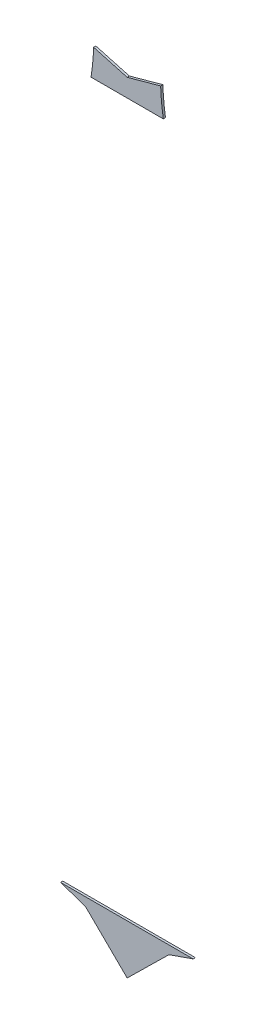
ISO-10303-21;
HEADER;
FILE_DESCRIPTION(('STEP AP214'),'2;1');
FILE_NAME('part.step','',(''),(''),'','','');
FILE_SCHEMA(('AUTOMOTIVE_DESIGN { 1 0 10303 214 1 1 1 1 }'));
ENDSEC;
DATA;
#1=APPLICATION_CONTEXT('core data for automotive mechanical design processes');
#2=APPLICATION_PROTOCOL_DEFINITION('international standard','automotive_design',2000,#1);
#3=PRODUCT_CONTEXT('',#1,'mechanical');
#4=PRODUCT('Part','Part','',(#3));
#5=PRODUCT_RELATED_PRODUCT_CATEGORY('part','',(#4));
#6=PRODUCT_DEFINITION_FORMATION('','',#4);
#7=PRODUCT_DEFINITION_CONTEXT('part definition',#1,'design');
#8=PRODUCT_DEFINITION('design','',#6,#7);
#9=PRODUCT_DEFINITION_SHAPE('','',#8);
#10=(LENGTH_UNIT() NAMED_UNIT(*) SI_UNIT(.MILLI.,.METRE.));
#11=(NAMED_UNIT(*) PLANE_ANGLE_UNIT() SI_UNIT($,.RADIAN.));
#12=(NAMED_UNIT(*) SI_UNIT($,.STERADIAN.) SOLID_ANGLE_UNIT());
#13=UNCERTAINTY_MEASURE_WITH_UNIT(LENGTH_MEASURE(1.E-05),#10,'distance_accuracy_value','');
#14=(GEOMETRIC_REPRESENTATION_CONTEXT(3) GLOBAL_UNCERTAINTY_ASSIGNED_CONTEXT((#13)) GLOBAL_UNIT_ASSIGNED_CONTEXT((#10,
#11,#12)) REPRESENTATION_CONTEXT('',''));
#15=CARTESIAN_POINT('',(0.,0.,0.));
#16=DIRECTION('',(0.,0.,1.));
#17=DIRECTION('',(1.,0.,0.));
#18=AXIS2_PLACEMENT_3D('',#15,#16,#17);
#19=CARTESIAN_POINT('',(39.2658083058148,-0.911572928917991,0.1));
#20=DIRECTION('',(-0.329181682712164,0.944266604178496,0.));
#21=DIRECTION('',(-0.944266604178496,-0.329181682712164,0.));
#22=AXIS2_PLACEMENT_3D('',#19,#20,#21);
#23=PLANE('',#22);
#24=DIRECTION('',(0.944266604178496,0.329181682712164,0.));
#25=VECTOR('',#24,1.);
#26=CARTESIAN_POINT('',(39.2658083058148,-0.911572928917991,0.));
#27=LINE('',#26,#25);
#28=CARTESIAN_POINT('',(38.1773001093702,-1.29103881086915,0.));
#29=VERTEX_POINT('',#28);
#30=CARTESIAN_POINT('',(39.2658083058148,-0.911572928917991,0.));
#31=VERTEX_POINT('',#30);
#32=EDGE_CURVE('E117',#29,#31,#27,.T.);
#33=ORIENTED_EDGE('',*,*,#32,.T.);
#34=DIRECTION('',(0.,0.,-1.));
#35=VECTOR('',#34,1.);
#36=CARTESIAN_POINT('',(39.2658083058148,-0.911572928917991,0.1));
#37=LINE('',#36,#35);
#38=CARTESIAN_POINT('',(39.2658083058148,-0.911572928917991,0.1));
#39=VERTEX_POINT('',#38);
#40=EDGE_CURVE('E12',#39,#31,#37,.T.);
#41=ORIENTED_EDGE('',*,*,#40,.F.);
#42=DIRECTION('',(0.944266604178496,0.329181682712164,0.));
#43=VECTOR('',#42,1.);
#44=CARTESIAN_POINT('',(39.2658083058148,-0.911572928917991,0.1));
#45=LINE('',#44,#43);
#46=CARTESIAN_POINT('',(38.1773001093702,-1.29103881086915,0.1));
#47=VERTEX_POINT('',#46);
#48=EDGE_CURVE('E125',#47,#39,#45,.T.);
#49=ORIENTED_EDGE('',*,*,#48,.F.);
#50=DIRECTION('',(0.,0.,-1.));
#51=VECTOR('',#50,1.);
#52=CARTESIAN_POINT('',(38.1773001093702,-1.29103881086915,0.1));
#53=LINE('',#52,#51);
#54=EDGE_CURVE('E113',#47,#29,#53,.T.);
#55=ORIENTED_EDGE('',*,*,#54,.T.);
#56=EDGE_LOOP('',(#33,#41,#49,#55));
#57=FACE_BOUND('',#56,.T.);
#58=ADVANCED_FACE('F43',(#57),#23,.F.);
#59=CARTESIAN_POINT('',(39.2658083058148,-0.911572928917991,0.1));
#60=DIRECTION('',(0.,-1.,0.));
#61=DIRECTION('',(0.,0.,-1.));
#62=AXIS2_PLACEMENT_3D('',#59,#60,#61);
#63=PLANE('',#62);
#64=DIRECTION('',(-1.,0.,0.));
#65=VECTOR('',#64,1.);
#66=CARTESIAN_POINT('',(39.2658083058148,-0.911572928917991,0.));
#67=LINE('',#66,#65);
#68=CARTESIAN_POINT('',(33.3110708178229,-0.911572928917991,0.));
#69=VERTEX_POINT('',#68);
#70=EDGE_CURVE('E120',#31,#69,#67,.T.);
#71=ORIENTED_EDGE('',*,*,#70,.T.);
#72=DIRECTION('',(0.,0.,-1.));
#73=VECTOR('',#72,1.);
#74=CARTESIAN_POINT('',(33.3110708178229,-0.911572928917991,0.1));
#75=LINE('',#74,#73);
#76=CARTESIAN_POINT('',(33.3110708178229,-0.911572928917991,0.1));
#77=VERTEX_POINT('',#76);
#78=EDGE_CURVE('E51',#77,#69,#75,.T.);
#79=ORIENTED_EDGE('',*,*,#78,.F.);
#80=DIRECTION('',(-1.,0.,0.));
#81=VECTOR('',#80,1.);
#82=CARTESIAN_POINT('',(39.2658083058148,-0.911572928917991,0.1));
#83=LINE('',#82,#81);
#84=EDGE_CURVE('E93',#39,#77,#83,.T.);
#85=ORIENTED_EDGE('',*,*,#84,.F.);
#86=ORIENTED_EDGE('',*,*,#40,.T.);
#87=EDGE_LOOP('',(#71,#79,#85,#86));
#88=FACE_BOUND('',#87,.T.);
#89=ADVANCED_FACE('F144',(#88),#63,.F.);
#90=CARTESIAN_POINT('',(34.4264076718275,-1.29121695948299,0.1));
#91=DIRECTION('',(0.322229485113042,0.946661586272404,0.));
#92=DIRECTION('',(-0.946661586272404,0.322229485113042,0.));
#93=AXIS2_PLACEMENT_3D('',#90,#91,#92);
#94=PLANE('',#93);
#95=DIRECTION('',(0.946661586272404,-0.322229485113042,0.));
#96=VECTOR('',#95,1.);
#97=CARTESIAN_POINT('',(34.4264076718275,-1.29121695948299,0.));
#98=LINE('',#97,#96);
#99=CARTESIAN_POINT('',(34.4264076718275,-1.29121695948299,0.));
#100=VERTEX_POINT('',#99);
#101=EDGE_CURVE('E108',#69,#100,#98,.T.);
#102=ORIENTED_EDGE('',*,*,#101,.T.);
#103=DIRECTION('',(0.,0.,-1.));
#104=VECTOR('',#103,1.);
#105=CARTESIAN_POINT('',(34.4264076718275,-1.29121695948299,0.1));
#106=LINE('',#105,#104);
#107=CARTESIAN_POINT('',(34.4264076718275,-1.29121695948299,0.1));
#108=VERTEX_POINT('',#107);
#109=EDGE_CURVE('E105',#108,#100,#106,.T.);
#110=ORIENTED_EDGE('',*,*,#109,.F.);
#111=DIRECTION('',(0.946661586272404,-0.322229485113042,0.));
#112=VECTOR('',#111,1.);
#113=CARTESIAN_POINT('',(34.4264076718275,-1.29121695948299,0.1));
#114=LINE('',#113,#112);
#115=EDGE_CURVE('E97',#77,#108,#114,.T.);
#116=ORIENTED_EDGE('',*,*,#115,.F.);
#117=ORIENTED_EDGE('',*,*,#78,.T.);
#118=EDGE_LOOP('',(#102,#110,#116,#117));
#119=FACE_BOUND('',#118,.T.);
#120=ADVANCED_FACE('F106',(#119),#94,.F.);
#121=CARTESIAN_POINT('',(36.301941466188,-3.1350188240396,0.1));
#122=DIRECTION('',(0.701048506646403,0.713113589359261,0.));
#123=DIRECTION('',(-0.71311358935926,0.701048506646403,0.));
#124=AXIS2_PLACEMENT_3D('',#121,#122,#123);
#125=PLANE('',#124);
#126=DIRECTION('',(0.713113589359261,-0.701048506646403,0.));
#127=VECTOR('',#126,1.);
#128=CARTESIAN_POINT('',(36.301941466188,-3.1350188240396,0.));
#129=LINE('',#128,#127);
#130=CARTESIAN_POINT('',(36.301941466188,-3.1350188240396,0.));
#131=VERTEX_POINT('',#130);
#132=EDGE_CURVE('E79',#100,#131,#129,.T.);
#133=ORIENTED_EDGE('',*,*,#132,.T.);
#134=DIRECTION('',(0.,0.,-1.));
#135=VECTOR('',#134,1.);
#136=CARTESIAN_POINT('',(36.301941466188,-3.1350188240396,0.1));
#137=LINE('',#136,#135);
#138=CARTESIAN_POINT('',(36.301941466188,-3.1350188240396,0.1));
#139=VERTEX_POINT('',#138);
#140=EDGE_CURVE('E109',#139,#131,#137,.T.);
#141=ORIENTED_EDGE('',*,*,#140,.F.);
#142=DIRECTION('',(0.713113589359261,-0.701048506646403,0.));
#143=VECTOR('',#142,1.);
#144=CARTESIAN_POINT('',(36.301941466188,-3.1350188240396,0.1));
#145=LINE('',#144,#143);
#146=EDGE_CURVE('E101',#108,#139,#145,.T.);
#147=ORIENTED_EDGE('',*,*,#146,.F.);
#148=ORIENTED_EDGE('',*,*,#109,.T.);
#149=EDGE_LOOP('',(#133,#141,#147,#148));
#150=FACE_BOUND('',#149,.T.);
#151=ADVANCED_FACE('F111',(#150),#125,.F.);
#152=CARTESIAN_POINT('',(38.1773001093702,-1.29103881086915,0.1));
#153=DIRECTION('',(-0.70111624213474,0.713046993552922,0.));
#154=DIRECTION('',(-0.713046993552922,-0.70111624213474,0.));
#155=AXIS2_PLACEMENT_3D('',#152,#153,#154);
#156=PLANE('',#155);
#157=DIRECTION('',(0.713046993552922,0.70111624213474,0.));
#158=VECTOR('',#157,1.);
#159=CARTESIAN_POINT('',(38.1773001093702,-1.29103881086915,0.));
#160=LINE('',#159,#158);
#161=EDGE_CURVE('E85',#131,#29,#160,.T.);
#162=ORIENTED_EDGE('',*,*,#161,.T.);
#163=ORIENTED_EDGE('',*,*,#54,.F.);
#164=DIRECTION('',(0.713046993552922,0.70111624213474,0.));
#165=VECTOR('',#164,1.);
#166=CARTESIAN_POINT('',(38.1773001093702,-1.29103881086915,0.1));
#167=LINE('',#166,#165);
#168=EDGE_CURVE('E59',#139,#47,#167,.T.);
#169=ORIENTED_EDGE('',*,*,#168,.F.);
#170=ORIENTED_EDGE('',*,*,#140,.T.);
#171=EDGE_LOOP('',(#162,#163,#169,#170));
#172=FACE_BOUND('',#171,.T.);
#173=ADVANCED_FACE('F133',(#172),#156,.F.);
#174=CARTESIAN_POINT('',(0.,0.,0.1));
#175=DIRECTION('',(0.,0.,-1.));
#176=DIRECTION('',(-1.,0.,0.));
#177=AXIS2_PLACEMENT_3D('',#174,#175,#176);
#178=PLANE('',#177);
#179=ORIENTED_EDGE('',*,*,#48,.T.);
#180=ORIENTED_EDGE('',*,*,#84,.T.);
#181=ORIENTED_EDGE('',*,*,#115,.T.);
#182=ORIENTED_EDGE('',*,*,#146,.T.);
#183=ORIENTED_EDGE('',*,*,#168,.T.);
#184=EDGE_LOOP('',(#179,#180,#181,#182,#183));
#185=FACE_BOUND('',#184,.T.);
#186=ADVANCED_FACE('F99',(#185),#178,.F.);
#187=CARTESIAN_POINT('',(0.,0.,0.));
#188=DIRECTION('',(0.,0.,-1.));
#189=DIRECTION('',(-1.,0.,0.));
#190=AXIS2_PLACEMENT_3D('',#187,#188,#189);
#191=PLANE('',#190);
#192=ORIENTED_EDGE('',*,*,#32,.F.);
#193=ORIENTED_EDGE('',*,*,#161,.F.);
#194=ORIENTED_EDGE('',*,*,#132,.F.);
#195=ORIENTED_EDGE('',*,*,#101,.F.);
#196=ORIENTED_EDGE('',*,*,#70,.F.);
#197=EDGE_LOOP('',(#192,#193,#194,#195,#196));
#198=FACE_BOUND('',#197,.T.);
#199=ADVANCED_FACE('F129',(#198),#191,.T.);
#200=CLOSED_SHELL('',(#58,#89,#120,#151,#173,#186,#199));
#201=MANIFOLD_SOLID_BREP('B2',#200);
#202=CARTESIAN_POINT('',(24.7934683392651,32.6659006487027,0.1));
#203=DIRECTION('',(0.,0.,-1.));
#204=DIRECTION('',(-1.,0.,0.));
#205=AXIS2_PLACEMENT_3D('',#202,#203,#204);
#206=CYLINDRICAL_SURFACE('',#205,10.0094980833378);
#207=CARTESIAN_POINT('',(24.7934683392651,32.6659006487027,0.));
#208=DIRECTION('',(0.,0.,-1.));
#209=DIRECTION('',(1.,0.,0.));
#210=AXIS2_PLACEMENT_3D('',#207,#208,#209);
#211=CIRCLE('',#210,10.0094980833378);
#212=CARTESIAN_POINT('',(34.7966395943562,32.3100682138936,0.));
#213=VERTEX_POINT('',#212);
#214=CARTESIAN_POINT('',(34.6778817761996,31.088427071082,0.));
#215=VERTEX_POINT('',#214);
#216=EDGE_CURVE('E267',#213,#215,#211,.T.);
#217=ORIENTED_EDGE('',*,*,#216,.T.);
#218=DIRECTION('',(0.,0.,-1.));
#219=VECTOR('',#218,1.);
#220=CARTESIAN_POINT('',(34.6778817761996,31.088427071082,0.1));
#221=LINE('',#220,#219);
#222=CARTESIAN_POINT('',(34.6778817761996,31.088427071082,0.1));
#223=VERTEX_POINT('',#222);
#224=EDGE_CURVE('E41',#223,#215,#221,.T.);
#225=ORIENTED_EDGE('',*,*,#224,.F.);
#226=CARTESIAN_POINT('',(24.7934683392651,32.6659006487027,0.1));
#227=DIRECTION('',(0.,0.,-1.));
#228=DIRECTION('',(1.,0.,0.));
#229=AXIS2_PLACEMENT_3D('',#226,#227,#228);
#230=CIRCLE('',#229,10.0094980833378);
#231=CARTESIAN_POINT('',(34.7966395943562,32.3100682138936,0.1));
#232=VERTEX_POINT('',#231);
#233=EDGE_CURVE('E275',#232,#223,#230,.T.);
#234=ORIENTED_EDGE('',*,*,#233,.F.);
#235=DIRECTION('',(0.,0.,-1.));
#236=VECTOR('',#235,1.);
#237=CARTESIAN_POINT('',(34.7966395943562,32.3100682138936,0.1));
#238=LINE('',#237,#236);
#239=EDGE_CURVE('E263',#232,#213,#238,.T.);
#240=ORIENTED_EDGE('',*,*,#239,.T.);
#241=EDGE_LOOP('',(#217,#225,#234,#240));
#242=FACE_BOUND('',#241,.T.);
#243=ADVANCED_FACE('F193',(#242),#206,.F.);
#244=CARTESIAN_POINT('',(34.6778817761996,31.088427071082,0.1));
#245=DIRECTION('',(0.,1.,0.));
#246=DIRECTION('',(0.,0.,1.));
#247=AXIS2_PLACEMENT_3D('',#244,#245,#246);
#248=PLANE('',#247);
#249=DIRECTION('',(1.,0.,0.));
#250=VECTOR('',#249,1.);
#251=CARTESIAN_POINT('',(34.6778817761996,31.088427071082,0.));
#252=LINE('',#251,#250);
#253=CARTESIAN_POINT('',(37.9227748759127,31.088427071082,0.));
#254=VERTEX_POINT('',#253);
#255=EDGE_CURVE('E270',#215,#254,#252,.T.);
#256=ORIENTED_EDGE('',*,*,#255,.T.);
#257=DIRECTION('',(0.,0.,-1.));
#258=VECTOR('',#257,1.);
#259=CARTESIAN_POINT('',(37.9227748759127,31.088427071082,0.1));
#260=LINE('',#259,#258);
#261=CARTESIAN_POINT('',(37.9227748759127,31.088427071082,0.1));
#262=VERTEX_POINT('',#261);
#263=EDGE_CURVE('E201',#262,#254,#260,.T.);
#264=ORIENTED_EDGE('',*,*,#263,.F.);
#265=DIRECTION('',(1.,0.,0.));
#266=VECTOR('',#265,1.);
#267=CARTESIAN_POINT('',(34.6778817761996,31.088427071082,0.1));
#268=LINE('',#267,#266);
#269=EDGE_CURVE('E243',#223,#262,#268,.T.);
#270=ORIENTED_EDGE('',*,*,#269,.F.);
#271=ORIENTED_EDGE('',*,*,#224,.T.);
#272=EDGE_LOOP('',(#256,#264,#270,#271));
#273=FACE_BOUND('',#272,.T.);
#274=ADVANCED_FACE('F294',(#273),#248,.F.);
#275=CARTESIAN_POINT('',(47.8070138122859,32.666993676907,0.1));
#276=DIRECTION('',(0.,0.,-1.));
#277=DIRECTION('',(-1.,0.,0.));
#278=AXIS2_PLACEMENT_3D('',#275,#276,#277);
#279=CYLINDRICAL_SURFACE('',#278,10.0094980833378);
#280=CARTESIAN_POINT('',(47.8070138122859,32.666993676907,0.));
#281=DIRECTION('',(0.,0.,-1.));
#282=DIRECTION('',(1.,0.,0.));
#283=AXIS2_PLACEMENT_3D('',#280,#281,#282);
#284=CIRCLE('',#283,10.0094980833378);
#285=CARTESIAN_POINT('',(37.8038764028433,32.3102110425878,0.));
#286=VERTEX_POINT('',#285);
#287=EDGE_CURVE('E258',#254,#286,#284,.T.);
#288=ORIENTED_EDGE('',*,*,#287,.T.);
#289=DIRECTION('',(0.,0.,-1.));
#290=VECTOR('',#289,1.);
#291=CARTESIAN_POINT('',(37.8038764028433,32.3102110425878,0.1));
#292=LINE('',#291,#290);
#293=CARTESIAN_POINT('',(37.8038764028433,32.3102110425878,0.1));
#294=VERTEX_POINT('',#293);
#295=EDGE_CURVE('E255',#294,#286,#292,.T.);
#296=ORIENTED_EDGE('',*,*,#295,.F.);
#297=CARTESIAN_POINT('',(47.8070138122859,32.666993676907,0.1));
#298=DIRECTION('',(0.,0.,-1.));
#299=DIRECTION('',(1.,0.,0.));
#300=AXIS2_PLACEMENT_3D('',#297,#298,#299);
#301=CIRCLE('',#300,10.0094980833378);
#302=EDGE_CURVE('E247',#262,#294,#301,.T.);
#303=ORIENTED_EDGE('',*,*,#302,.F.);
#304=ORIENTED_EDGE('',*,*,#263,.T.);
#305=EDGE_LOOP('',(#288,#296,#303,#304));
#306=FACE_BOUND('',#305,.T.);
#307=ADVANCED_FACE('F256',(#306),#279,.F.);
#308=CARTESIAN_POINT('',(37.8038764028433,32.3102110425878,0.1));
#309=DIRECTION('',(0.26622205881868,-0.963911725936739,0.));
#310=DIRECTION('',(0.963911725936739,0.26622205881868,0.));
#311=AXIS2_PLACEMENT_3D('',#308,#309,#310);
#312=PLANE('',#311);
#313=DIRECTION('',(-0.963911725936739,-0.26622205881868,0.));
#314=VECTOR('',#313,1.);
#315=CARTESIAN_POINT('',(37.8038764028433,32.3102110425878,0.));
#316=LINE('',#315,#314);
#317=CARTESIAN_POINT('',(36.3017769907158,31.8953473291515,0.));
#318=VERTEX_POINT('',#317);
#319=EDGE_CURVE('E229',#286,#318,#316,.T.);
#320=ORIENTED_EDGE('',*,*,#319,.T.);
#321=DIRECTION('',(0.,0.,-1.));
#322=VECTOR('',#321,1.);
#323=CARTESIAN_POINT('',(36.3017769907158,31.8953473291515,0.1));
#324=LINE('',#323,#322);
#325=CARTESIAN_POINT('',(36.3017769907158,31.8953473291515,0.1));
#326=VERTEX_POINT('',#325);
#327=EDGE_CURVE('E259',#326,#318,#324,.T.);
#328=ORIENTED_EDGE('',*,*,#327,.F.);
#329=DIRECTION('',(-0.963911725936739,-0.26622205881868,0.));
#330=VECTOR('',#329,1.);
#331=CARTESIAN_POINT('',(37.8038764028433,32.3102110425878,0.1));
#332=LINE('',#331,#330);
#333=EDGE_CURVE('E251',#294,#326,#332,.T.);
#334=ORIENTED_EDGE('',*,*,#333,.F.);
#335=ORIENTED_EDGE('',*,*,#295,.T.);
#336=EDGE_LOOP('',(#320,#328,#334,#335));
#337=FACE_BOUND('',#336,.T.);
#338=ADVANCED_FACE('F261',(#337),#312,.F.);
#339=CARTESIAN_POINT('',(34.7966395943562,32.3100682138936,0.1));
#340=DIRECTION('',(-0.265637664121525,-0.964072938838167,0.));
#341=DIRECTION('',(0.964072938838167,-0.265637664121525,0.));
#342=AXIS2_PLACEMENT_3D('',#339,#340,#341);
#343=PLANE('',#342);
#344=DIRECTION('',(-0.964072938838167,0.265637664121525,0.));
#345=VECTOR('',#344,1.);
#346=CARTESIAN_POINT('',(34.7966395943562,32.3100682138936,0.));
#347=LINE('',#346,#345);
#348=EDGE_CURVE('E235',#318,#213,#347,.T.);
#349=ORIENTED_EDGE('',*,*,#348,.T.);
#350=ORIENTED_EDGE('',*,*,#239,.F.);
#351=DIRECTION('',(-0.964072938838167,0.265637664121525,0.));
#352=VECTOR('',#351,1.);
#353=CARTESIAN_POINT('',(34.7966395943562,32.3100682138936,0.1));
#354=LINE('',#353,#352);
#355=EDGE_CURVE('E209',#326,#232,#354,.T.);
#356=ORIENTED_EDGE('',*,*,#355,.F.);
#357=ORIENTED_EDGE('',*,*,#327,.T.);
#358=EDGE_LOOP('',(#349,#350,#356,#357));
#359=FACE_BOUND('',#358,.T.);
#360=ADVANCED_FACE('F283',(#359),#343,.F.);
#361=CARTESIAN_POINT('',(24.7934683392651,32.6659006487027,0.1));
#362=DIRECTION('',(0.,0.,1.));
#363=DIRECTION('',(1.,0.,0.));
#364=AXIS2_PLACEMENT_3D('',#361,#362,#363);
#365=PLANE('',#364);
#366=ORIENTED_EDGE('',*,*,#233,.T.);
#367=ORIENTED_EDGE('',*,*,#269,.T.);
#368=ORIENTED_EDGE('',*,*,#302,.T.);
#369=ORIENTED_EDGE('',*,*,#333,.T.);
#370=ORIENTED_EDGE('',*,*,#355,.T.);
#371=EDGE_LOOP('',(#366,#367,#368,#369,#370));
#372=FACE_BOUND('',#371,.T.);
#373=ADVANCED_FACE('F249',(#372),#365,.T.);
#374=CARTESIAN_POINT('',(24.7934683392651,32.6659006487027,0.));
#375=DIRECTION('',(0.,0.,1.));
#376=DIRECTION('',(1.,0.,0.));
#377=AXIS2_PLACEMENT_3D('',#374,#375,#376);
#378=PLANE('',#377);
#379=ORIENTED_EDGE('',*,*,#216,.F.);
#380=ORIENTED_EDGE('',*,*,#348,.F.);
#381=ORIENTED_EDGE('',*,*,#319,.F.);
#382=ORIENTED_EDGE('',*,*,#287,.F.);
#383=ORIENTED_EDGE('',*,*,#255,.F.);
#384=EDGE_LOOP('',(#379,#380,#381,#382,#383));
#385=FACE_BOUND('',#384,.T.);
#386=ADVANCED_FACE('F279',(#385),#378,.F.);
#387=CLOSED_SHELL('',(#243,#274,#307,#338,#360,#373,#386));
#388=MANIFOLD_SOLID_BREP('B6',#387);
#389=ADVANCED_BREP_SHAPE_REPRESENTATION('',(#18,#201,#388),#14);
#390=SHAPE_DEFINITION_REPRESENTATION(#9,#389);
ENDSEC;
END-ISO-10303-21;
